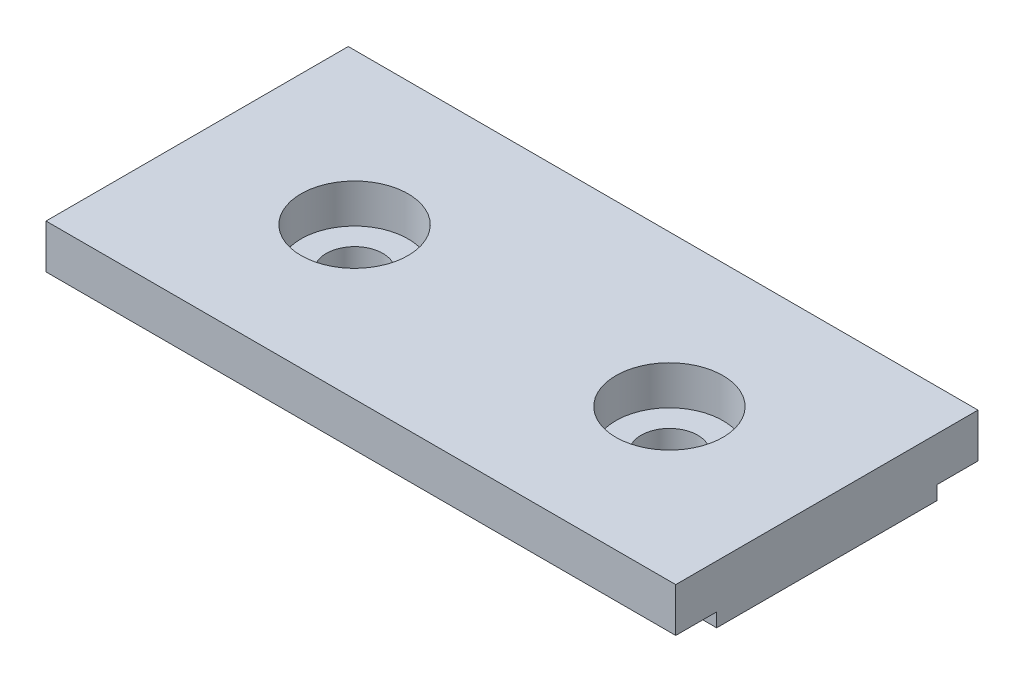
ISO-10303-21;
HEADER;
FILE_DESCRIPTION(('STEP AP214'),'2;1');
FILE_NAME('part.step','',(''),(''),'','','');
FILE_SCHEMA(('AUTOMOTIVE_DESIGN { 1 0 10303 214 1 1 1 1 }'));
ENDSEC;
DATA;
#1=APPLICATION_CONTEXT('core data for automotive mechanical design processes');
#2=APPLICATION_PROTOCOL_DEFINITION('international standard','automotive_design',2000,#1);
#3=PRODUCT_CONTEXT('',#1,'mechanical');
#4=PRODUCT('Part','Part','',(#3));
#5=PRODUCT_RELATED_PRODUCT_CATEGORY('part','',(#4));
#6=PRODUCT_DEFINITION_FORMATION('','',#4);
#7=PRODUCT_DEFINITION_CONTEXT('part definition',#1,'design');
#8=PRODUCT_DEFINITION('design','',#6,#7);
#9=PRODUCT_DEFINITION_SHAPE('','',#8);
#10=(LENGTH_UNIT() NAMED_UNIT(*) SI_UNIT(.MILLI.,.METRE.));
#11=(NAMED_UNIT(*) PLANE_ANGLE_UNIT() SI_UNIT($,.RADIAN.));
#12=(NAMED_UNIT(*) SI_UNIT($,.STERADIAN.) SOLID_ANGLE_UNIT());
#13=UNCERTAINTY_MEASURE_WITH_UNIT(LENGTH_MEASURE(1.E-05),#10,'distance_accuracy_value','');
#14=(GEOMETRIC_REPRESENTATION_CONTEXT(3) GLOBAL_UNCERTAINTY_ASSIGNED_CONTEXT((#13)) GLOBAL_UNIT_ASSIGNED_CONTEXT((#10,
#11,#12)) REPRESENTATION_CONTEXT('',''));
#15=CARTESIAN_POINT('',(0.,0.,0.));
#16=DIRECTION('',(0.,0.,1.));
#17=DIRECTION('',(1.,0.,0.));
#18=AXIS2_PLACEMENT_3D('',#15,#16,#17);
#19=CARTESIAN_POINT('',(50.,6.94545454545454,-12.));
#20=DIRECTION('',(0.,0.,1.));
#21=DIRECTION('',(1.,0.,0.));
#22=AXIS2_PLACEMENT_3D('',#19,#20,#21);
#23=PLANE('',#22);
#24=DIRECTION('',(0.,1.,0.));
#25=VECTOR('',#24,1.);
#26=CARTESIAN_POINT('',(0.,6.94545454545454,-12.));
#27=LINE('',#26,#25);
#28=CARTESIAN_POINT('',(0.,3.44545454545454,-12.));
#29=VERTEX_POINT('',#28);
#30=CARTESIAN_POINT('',(0.,6.94545454545454,-12.));
#31=VERTEX_POINT('',#30);
#32=EDGE_CURVE('E129',#29,#31,#27,.T.);
#33=ORIENTED_EDGE('',*,*,#32,.T.);
#34=DIRECTION('',(-1.,0.,0.));
#35=VECTOR('',#34,1.);
#36=CARTESIAN_POINT('',(50.,6.94545454545454,-12.));
#37=LINE('',#36,#35);
#38=CARTESIAN_POINT('',(50.,6.94545454545454,-12.));
#39=VERTEX_POINT('',#38);
#40=EDGE_CURVE('E11',#39,#31,#37,.T.);
#41=ORIENTED_EDGE('',*,*,#40,.F.);
#42=DIRECTION('',(0.,1.,0.));
#43=VECTOR('',#42,1.);
#44=CARTESIAN_POINT('',(50.,6.94545454545454,-12.));
#45=LINE('',#44,#43);
#46=CARTESIAN_POINT('',(50.,3.44545454545454,-12.));
#47=VERTEX_POINT('',#46);
#48=EDGE_CURVE('E144',#47,#39,#45,.T.);
#49=ORIENTED_EDGE('',*,*,#48,.F.);
#50=DIRECTION('',(-1.,0.,0.));
#51=VECTOR('',#50,1.);
#52=CARTESIAN_POINT('',(50.,3.44545454545454,-12.));
#53=LINE('',#52,#51);
#54=EDGE_CURVE('E125',#47,#29,#53,.T.);
#55=ORIENTED_EDGE('',*,*,#54,.T.);
#56=EDGE_LOOP('',(#33,#41,#49,#55));
#57=FACE_BOUND('',#56,.T.);
#58=ADVANCED_FACE('F33',(#57),#23,.F.);
#59=CARTESIAN_POINT('',(50.,6.94545454545454,12.));
#60=DIRECTION('',(0.,-1.,0.));
#61=DIRECTION('',(0.,0.,-1.));
#62=AXIS2_PLACEMENT_3D('',#59,#60,#61);
#63=PLANE('',#62);
#64=CARTESIAN_POINT('',(12.5,6.94545454545454,0.));
#65=DIRECTION('',(0.,1.,0.));
#66=DIRECTION('',(0.,0.,1.));
#67=AXIS2_PLACEMENT_3D('',#64,#65,#66);
#68=CIRCLE('',#67,4.24999999999999);
#69=CARTESIAN_POINT('',(12.5,6.94545454545454,4.24999999999999));
#70=VERTEX_POINT('',#69);
#71=EDGE_CURVE('E197',#70,#70,#68,.T.);
#72=ORIENTED_EDGE('',*,*,#71,.F.);
#73=EDGE_LOOP('',(#72));
#74=FACE_BOUND('',#73,.T.);
#75=CARTESIAN_POINT('',(37.5,6.94545454545454,0.));
#76=DIRECTION('',(0.,1.,0.));
#77=DIRECTION('',(0.,0.,1.));
#78=AXIS2_PLACEMENT_3D('',#75,#76,#77);
#79=CIRCLE('',#78,4.24999999999999);
#80=CARTESIAN_POINT('',(37.5,6.94545454545454,4.24999999999999));
#81=VERTEX_POINT('',#80);
#82=EDGE_CURVE('E185',#81,#81,#79,.T.);
#83=ORIENTED_EDGE('',*,*,#82,.F.);
#84=EDGE_LOOP('',(#83));
#85=FACE_BOUND('',#84,.T.);
#86=DIRECTION('',(0.,0.,1.));
#87=VECTOR('',#86,1.);
#88=CARTESIAN_POINT('',(0.,6.94545454545454,12.));
#89=LINE('',#88,#87);
#90=CARTESIAN_POINT('',(0.,6.94545454545454,12.));
#91=VERTEX_POINT('',#90);
#92=EDGE_CURVE('E132',#31,#91,#89,.T.);
#93=ORIENTED_EDGE('',*,*,#92,.T.);
#94=DIRECTION('',(-1.,0.,0.));
#95=VECTOR('',#94,1.);
#96=CARTESIAN_POINT('',(50.,6.94545454545454,12.));
#97=LINE('',#96,#95);
#98=CARTESIAN_POINT('',(50.,6.94545454545454,12.));
#99=VERTEX_POINT('',#98);
#100=EDGE_CURVE('E41',#99,#91,#97,.T.);
#101=ORIENTED_EDGE('',*,*,#100,.F.);
#102=DIRECTION('',(0.,0.,1.));
#103=VECTOR('',#102,1.);
#104=CARTESIAN_POINT('',(50.,6.94545454545454,12.));
#105=LINE('',#104,#103);
#106=EDGE_CURVE('E92',#39,#99,#105,.T.);
#107=ORIENTED_EDGE('',*,*,#106,.F.);
#108=ORIENTED_EDGE('',*,*,#40,.T.);
#109=EDGE_LOOP('',(#93,#101,#107,#108));
#110=FACE_BOUND('',#109,.T.);
#111=ADVANCED_FACE('F203',(#74,#85,#110),#63,.F.);
#112=CARTESIAN_POINT('',(50.,6.94545454545454,12.));
#113=DIRECTION('',(0.,0.,-1.));
#114=DIRECTION('',(-1.,0.,0.));
#115=AXIS2_PLACEMENT_3D('',#112,#113,#114);
#116=PLANE('',#115);
#117=DIRECTION('',(0.,-1.,0.));
#118=VECTOR('',#117,1.);
#119=CARTESIAN_POINT('',(0.,6.94545454545454,12.));
#120=LINE('',#119,#118);
#121=CARTESIAN_POINT('',(0.,3.44545454545454,12.));
#122=VERTEX_POINT('',#121);
#123=EDGE_CURVE('E135',#91,#122,#120,.T.);
#124=ORIENTED_EDGE('',*,*,#123,.T.);
#125=DIRECTION('',(-1.,0.,0.));
#126=VECTOR('',#125,1.);
#127=CARTESIAN_POINT('',(50.,3.44545454545454,12.));
#128=LINE('',#127,#126);
#129=CARTESIAN_POINT('',(50.,3.44545454545454,12.));
#130=VERTEX_POINT('',#129);
#131=EDGE_CURVE('E151',#130,#122,#128,.T.);
#132=ORIENTED_EDGE('',*,*,#131,.F.);
#133=DIRECTION('',(0.,-1.,0.));
#134=VECTOR('',#133,1.);
#135=CARTESIAN_POINT('',(50.,6.94545454545454,12.));
#136=LINE('',#135,#134);
#137=EDGE_CURVE('E159',#99,#130,#136,.T.);
#138=ORIENTED_EDGE('',*,*,#137,.F.);
#139=ORIENTED_EDGE('',*,*,#100,.T.);
#140=EDGE_LOOP('',(#124,#132,#138,#139));
#141=FACE_BOUND('',#140,.T.);
#142=ADVANCED_FACE('F157',(#141),#116,.F.);
#143=CARTESIAN_POINT('',(50.,3.44545454545454,12.));
#144=DIRECTION('',(0.,1.,0.));
#145=DIRECTION('',(0.,0.,1.));
#146=AXIS2_PLACEMENT_3D('',#143,#144,#145);
#147=PLANE('',#146);
#148=DIRECTION('',(0.,0.,-1.));
#149=VECTOR('',#148,1.);
#150=CARTESIAN_POINT('',(0.,3.44545454545454,12.));
#151=LINE('',#150,#149);
#152=CARTESIAN_POINT('',(0.,3.44545454545454,8.75));
#153=VERTEX_POINT('',#152);
#154=EDGE_CURVE('E137',#122,#153,#151,.T.);
#155=ORIENTED_EDGE('',*,*,#154,.T.);
#156=DIRECTION('',(-1.,0.,0.));
#157=VECTOR('',#156,1.);
#158=CARTESIAN_POINT('',(50.,3.44545454545454,8.75));
#159=LINE('',#158,#157);
#160=CARTESIAN_POINT('',(50.,3.44545454545454,8.75));
#161=VERTEX_POINT('',#160);
#162=EDGE_CURVE('E148',#161,#153,#159,.T.);
#163=ORIENTED_EDGE('',*,*,#162,.F.);
#164=DIRECTION('',(0.,0.,-1.));
#165=VECTOR('',#164,1.);
#166=CARTESIAN_POINT('',(50.,3.44545454545454,12.));
#167=LINE('',#166,#165);
#168=EDGE_CURVE('E171',#130,#161,#167,.T.);
#169=ORIENTED_EDGE('',*,*,#168,.F.);
#170=ORIENTED_EDGE('',*,*,#131,.T.);
#171=EDGE_LOOP('',(#155,#163,#169,#170));
#172=FACE_BOUND('',#171,.T.);
#173=ADVANCED_FACE('F167',(#172),#147,.F.);
#174=CARTESIAN_POINT('',(50.,3.44545454545454,8.75));
#175=DIRECTION('',(0.,0.,-1.));
#176=DIRECTION('',(-1.,0.,0.));
#177=AXIS2_PLACEMENT_3D('',#174,#175,#176);
#178=PLANE('',#177);
#179=DIRECTION('',(0.,-1.,0.));
#180=VECTOR('',#179,1.);
#181=CARTESIAN_POINT('',(0.,3.44545454545454,8.75));
#182=LINE('',#181,#180);
#183=CARTESIAN_POINT('',(0.,2.34545454545454,8.75));
#184=VERTEX_POINT('',#183);
#185=EDGE_CURVE('E139',#153,#184,#182,.T.);
#186=ORIENTED_EDGE('',*,*,#185,.T.);
#187=DIRECTION('',(-1.,0.,0.));
#188=VECTOR('',#187,1.);
#189=CARTESIAN_POINT('',(50.,2.34545454545454,8.75));
#190=LINE('',#189,#188);
#191=CARTESIAN_POINT('',(50.,2.34545454545454,8.75));
#192=VERTEX_POINT('',#191);
#193=EDGE_CURVE('E120',#192,#184,#190,.T.);
#194=ORIENTED_EDGE('',*,*,#193,.F.);
#195=DIRECTION('',(0.,-1.,0.));
#196=VECTOR('',#195,1.);
#197=CARTESIAN_POINT('',(50.,3.44545454545454,8.75));
#198=LINE('',#197,#196);
#199=EDGE_CURVE('E111',#161,#192,#198,.T.);
#200=ORIENTED_EDGE('',*,*,#199,.F.);
#201=ORIENTED_EDGE('',*,*,#162,.T.);
#202=EDGE_LOOP('',(#186,#194,#200,#201));
#203=FACE_BOUND('',#202,.T.);
#204=ADVANCED_FACE('F170',(#203),#178,.F.);
#205=CARTESIAN_POINT('',(50.,2.34545454545454,-8.75));
#206=DIRECTION('',(0.,1.,0.));
#207=DIRECTION('',(0.,0.,1.));
#208=AXIS2_PLACEMENT_3D('',#205,#206,#207);
#209=PLANE('',#208);
#210=CARTESIAN_POINT('',(12.5,2.34545454545454,0.));
#211=DIRECTION('',(0.,1.,0.));
#212=DIRECTION('',(0.,0.,1.));
#213=AXIS2_PLACEMENT_3D('',#210,#211,#212);
#214=CIRCLE('',#213,2.25);
#215=CARTESIAN_POINT('',(12.5,2.34545454545454,2.25));
#216=VERTEX_POINT('',#215);
#217=EDGE_CURVE('E188',#216,#216,#214,.T.);
#218=ORIENTED_EDGE('',*,*,#217,.T.);
#219=EDGE_LOOP('',(#218));
#220=FACE_BOUND('',#219,.T.);
#221=CARTESIAN_POINT('',(37.5,2.34545454545454,0.));
#222=DIRECTION('',(0.,1.,0.));
#223=DIRECTION('',(0.,0.,1.));
#224=AXIS2_PLACEMENT_3D('',#221,#222,#223);
#225=CIRCLE('',#224,2.25);
#226=CARTESIAN_POINT('',(37.5,2.34545454545454,2.25));
#227=VERTEX_POINT('',#226);
#228=EDGE_CURVE('E133',#227,#227,#225,.T.);
#229=ORIENTED_EDGE('',*,*,#228,.T.);
#230=EDGE_LOOP('',(#229));
#231=FACE_BOUND('',#230,.T.);
#232=DIRECTION('',(0.,0.,-1.));
#233=VECTOR('',#232,1.);
#234=CARTESIAN_POINT('',(0.,2.34545454545454,-8.75));
#235=LINE('',#234,#233);
#236=CARTESIAN_POINT('',(0.,2.34545454545454,-8.75));
#237=VERTEX_POINT('',#236);
#238=EDGE_CURVE('E119',#184,#237,#235,.T.);
#239=ORIENTED_EDGE('',*,*,#238,.T.);
#240=DIRECTION('',(-1.,0.,0.));
#241=VECTOR('',#240,1.);
#242=CARTESIAN_POINT('',(50.,2.34545454545454,-8.75));
#243=LINE('',#242,#241);
#244=CARTESIAN_POINT('',(50.,2.34545454545454,-8.75));
#245=VERTEX_POINT('',#244);
#246=EDGE_CURVE('E116',#245,#237,#243,.T.);
#247=ORIENTED_EDGE('',*,*,#246,.F.);
#248=DIRECTION('',(0.,0.,-1.));
#249=VECTOR('',#248,1.);
#250=CARTESIAN_POINT('',(50.,2.34545454545454,-8.75));
#251=LINE('',#250,#249);
#252=EDGE_CURVE('E105',#192,#245,#251,.T.);
#253=ORIENTED_EDGE('',*,*,#252,.F.);
#254=ORIENTED_EDGE('',*,*,#193,.T.);
#255=EDGE_LOOP('',(#239,#247,#253,#254));
#256=FACE_BOUND('',#255,.T.);
#257=ADVANCED_FACE('F117',(#220,#231,#256),#209,.F.);
#258=CARTESIAN_POINT('',(50.,3.44545454545454,-8.75));
#259=DIRECTION('',(0.,0.,1.));
#260=DIRECTION('',(1.,0.,0.));
#261=AXIS2_PLACEMENT_3D('',#258,#259,#260);
#262=PLANE('',#261);
#263=DIRECTION('',(0.,1.,0.));
#264=VECTOR('',#263,1.);
#265=CARTESIAN_POINT('',(0.,3.44545454545454,-8.75));
#266=LINE('',#265,#264);
#267=CARTESIAN_POINT('',(0.,3.44545454545454,-8.75));
#268=VERTEX_POINT('',#267);
#269=EDGE_CURVE('E78',#237,#268,#266,.T.);
#270=ORIENTED_EDGE('',*,*,#269,.T.);
#271=DIRECTION('',(-1.,0.,0.));
#272=VECTOR('',#271,1.);
#273=CARTESIAN_POINT('',(50.,3.44545454545454,-8.75));
#274=LINE('',#273,#272);
#275=CARTESIAN_POINT('',(50.,3.44545454545454,-8.75));
#276=VERTEX_POINT('',#275);
#277=EDGE_CURVE('E121',#276,#268,#274,.T.);
#278=ORIENTED_EDGE('',*,*,#277,.F.);
#279=DIRECTION('',(0.,1.,0.));
#280=VECTOR('',#279,1.);
#281=CARTESIAN_POINT('',(50.,3.44545454545454,-8.75));
#282=LINE('',#281,#280);
#283=EDGE_CURVE('E109',#245,#276,#282,.T.);
#284=ORIENTED_EDGE('',*,*,#283,.F.);
#285=ORIENTED_EDGE('',*,*,#246,.T.);
#286=EDGE_LOOP('',(#270,#278,#284,#285));
#287=FACE_BOUND('',#286,.T.);
#288=ADVANCED_FACE('F123',(#287),#262,.F.);
#289=CARTESIAN_POINT('',(50.,3.44545454545454,-12.));
#290=DIRECTION('',(0.,1.,0.));
#291=DIRECTION('',(0.,0.,1.));
#292=AXIS2_PLACEMENT_3D('',#289,#290,#291);
#293=PLANE('',#292);
#294=DIRECTION('',(0.,0.,-1.));
#295=VECTOR('',#294,1.);
#296=CARTESIAN_POINT('',(0.,3.44545454545454,-12.));
#297=LINE('',#296,#295);
#298=EDGE_CURVE('E84',#268,#29,#297,.T.);
#299=ORIENTED_EDGE('',*,*,#298,.T.);
#300=ORIENTED_EDGE('',*,*,#54,.F.);
#301=DIRECTION('',(0.,0.,-1.));
#302=VECTOR('',#301,1.);
#303=CARTESIAN_POINT('',(50.,3.44545454545454,-12.));
#304=LINE('',#303,#302);
#305=EDGE_CURVE('E49',#276,#47,#304,.T.);
#306=ORIENTED_EDGE('',*,*,#305,.F.);
#307=ORIENTED_EDGE('',*,*,#277,.T.);
#308=EDGE_LOOP('',(#299,#300,#306,#307));
#309=FACE_BOUND('',#308,.T.);
#310=ADVANCED_FACE('F210',(#309),#293,.F.);
#311=CARTESIAN_POINT('',(50.,0.,0.));
#312=DIRECTION('',(-1.,0.,0.));
#313=DIRECTION('',(0.,0.,1.));
#314=AXIS2_PLACEMENT_3D('',#311,#312,#313);
#315=PLANE('',#314);
#316=ORIENTED_EDGE('',*,*,#48,.T.);
#317=ORIENTED_EDGE('',*,*,#106,.T.);
#318=ORIENTED_EDGE('',*,*,#137,.T.);
#319=ORIENTED_EDGE('',*,*,#168,.T.);
#320=ORIENTED_EDGE('',*,*,#199,.T.);
#321=ORIENTED_EDGE('',*,*,#252,.T.);
#322=ORIENTED_EDGE('',*,*,#283,.T.);
#323=ORIENTED_EDGE('',*,*,#305,.T.);
#324=EDGE_LOOP('',(#316,#317,#318,#319,#320,#321,#322,#323));
#325=FACE_BOUND('',#324,.T.);
#326=ADVANCED_FACE('F107',(#325),#315,.F.);
#327=CARTESIAN_POINT('',(0.,0.,0.));
#328=DIRECTION('',(-1.,0.,0.));
#329=DIRECTION('',(0.,0.,1.));
#330=AXIS2_PLACEMENT_3D('',#327,#328,#329);
#331=PLANE('',#330);
#332=ORIENTED_EDGE('',*,*,#32,.F.);
#333=ORIENTED_EDGE('',*,*,#298,.F.);
#334=ORIENTED_EDGE('',*,*,#269,.F.);
#335=ORIENTED_EDGE('',*,*,#238,.F.);
#336=ORIENTED_EDGE('',*,*,#185,.F.);
#337=ORIENTED_EDGE('',*,*,#154,.F.);
#338=ORIENTED_EDGE('',*,*,#123,.F.);
#339=ORIENTED_EDGE('',*,*,#92,.F.);
#340=EDGE_LOOP('',(#332,#333,#334,#335,#336,#337,#338,#339));
#341=FACE_BOUND('',#340,.T.);
#342=ADVANCED_FACE('F163',(#341),#331,.T.);
#343=CARTESIAN_POINT('',(37.5,6.94545454545454,0.));
#344=DIRECTION('',(0.,1.,0.));
#345=DIRECTION('',(0.,0.,1.));
#346=AXIS2_PLACEMENT_3D('',#343,#344,#345);
#347=CYLINDRICAL_SURFACE('',#346,2.25000000000001);
#348=ORIENTED_EDGE('',*,*,#228,.F.);
#349=EDGE_LOOP('',(#348));
#350=FACE_BOUND('',#349,.T.);
#351=CARTESIAN_POINT('',(37.5,3.84545454545454,0.));
#352=DIRECTION('',(0.,1.,0.));
#353=DIRECTION('',(0.,0.,1.));
#354=AXIS2_PLACEMENT_3D('',#351,#352,#353);
#355=CIRCLE('',#354,2.25000000000002);
#356=CARTESIAN_POINT('',(37.5,3.84545454545454,2.25000000000002));
#357=VERTEX_POINT('',#356);
#358=EDGE_CURVE('E179',#357,#357,#355,.T.);
#359=ORIENTED_EDGE('',*,*,#358,.T.);
#360=EDGE_LOOP('',(#359));
#361=FACE_BOUND('',#360,.T.);
#362=ADVANCED_FACE('F275',(#350,#361),#347,.F.);
#363=CARTESIAN_POINT('',(39.75,3.84545454545454,0.));
#364=DIRECTION('',(0.,-1.,0.));
#365=DIRECTION('',(0.,0.,-1.));
#366=AXIS2_PLACEMENT_3D('',#363,#364,#365);
#367=PLANE('',#366);
#368=ORIENTED_EDGE('',*,*,#358,.F.);
#369=EDGE_LOOP('',(#368));
#370=FACE_BOUND('',#369,.T.);
#371=CARTESIAN_POINT('',(37.5,3.84545454545454,0.));
#372=DIRECTION('',(0.,1.,0.));
#373=DIRECTION('',(0.,0.,1.));
#374=AXIS2_PLACEMENT_3D('',#371,#372,#373);
#375=CIRCLE('',#374,4.24999999999999);
#376=CARTESIAN_POINT('',(37.5,3.84545454545454,4.24999999999999));
#377=VERTEX_POINT('',#376);
#378=EDGE_CURVE('E182',#377,#377,#375,.T.);
#379=ORIENTED_EDGE('',*,*,#378,.T.);
#380=EDGE_LOOP('',(#379));
#381=FACE_BOUND('',#380,.T.);
#382=ADVANCED_FACE('F283',(#370,#381),#367,.F.);
#383=CARTESIAN_POINT('',(37.5,6.94545454545454,0.));
#384=DIRECTION('',(0.,1.,0.));
#385=DIRECTION('',(0.,0.,1.));
#386=AXIS2_PLACEMENT_3D('',#383,#384,#385);
#387=CYLINDRICAL_SURFACE('',#386,4.24999999999999);
#388=ORIENTED_EDGE('',*,*,#378,.F.);
#389=EDGE_LOOP('',(#388));
#390=FACE_BOUND('',#389,.T.);
#391=ORIENTED_EDGE('',*,*,#82,.T.);
#392=EDGE_LOOP('',(#391));
#393=FACE_BOUND('',#392,.T.);
#394=ADVANCED_FACE('F290',(#390,#393),#387,.F.);
#395=CARTESIAN_POINT('',(12.5,6.94545454545454,0.));
#396=DIRECTION('',(0.,1.,0.));
#397=DIRECTION('',(0.,0.,1.));
#398=AXIS2_PLACEMENT_3D('',#395,#396,#397);
#399=CYLINDRICAL_SURFACE('',#398,2.25000000000001);
#400=ORIENTED_EDGE('',*,*,#217,.F.);
#401=EDGE_LOOP('',(#400));
#402=FACE_BOUND('',#401,.T.);
#403=CARTESIAN_POINT('',(12.5,3.84545454545454,0.));
#404=DIRECTION('',(0.,1.,0.));
#405=DIRECTION('',(0.,0.,1.));
#406=AXIS2_PLACEMENT_3D('',#403,#404,#405);
#407=CIRCLE('',#406,2.25000000000001);
#408=CARTESIAN_POINT('',(12.5,3.84545454545454,2.25000000000001));
#409=VERTEX_POINT('',#408);
#410=EDGE_CURVE('E191',#409,#409,#407,.T.);
#411=ORIENTED_EDGE('',*,*,#410,.T.);
#412=EDGE_LOOP('',(#411));
#413=FACE_BOUND('',#412,.T.);
#414=ADVANCED_FACE('F298',(#402,#413),#399,.F.);
#415=CARTESIAN_POINT('',(14.75,3.84545454545454,0.));
#416=DIRECTION('',(0.,-1.,0.));
#417=DIRECTION('',(0.,0.,-1.));
#418=AXIS2_PLACEMENT_3D('',#415,#416,#417);
#419=PLANE('',#418);
#420=ORIENTED_EDGE('',*,*,#410,.F.);
#421=EDGE_LOOP('',(#420));
#422=FACE_BOUND('',#421,.T.);
#423=CARTESIAN_POINT('',(12.5,3.84545454545454,0.));
#424=DIRECTION('',(0.,1.,0.));
#425=DIRECTION('',(0.,0.,1.));
#426=AXIS2_PLACEMENT_3D('',#423,#424,#425);
#427=CIRCLE('',#426,4.24999999999999);
#428=CARTESIAN_POINT('',(12.5,3.84545454545454,4.24999999999999));
#429=VERTEX_POINT('',#428);
#430=EDGE_CURVE('E194',#429,#429,#427,.T.);
#431=ORIENTED_EDGE('',*,*,#430,.T.);
#432=EDGE_LOOP('',(#431));
#433=FACE_BOUND('',#432,.T.);
#434=ADVANCED_FACE('F306',(#422,#433),#419,.F.);
#435=CARTESIAN_POINT('',(12.5,6.94545454545454,0.));
#436=DIRECTION('',(0.,1.,0.));
#437=DIRECTION('',(0.,0.,1.));
#438=AXIS2_PLACEMENT_3D('',#435,#436,#437);
#439=CYLINDRICAL_SURFACE('',#438,4.24999999999999);
#440=ORIENTED_EDGE('',*,*,#430,.F.);
#441=EDGE_LOOP('',(#440));
#442=FACE_BOUND('',#441,.T.);
#443=ORIENTED_EDGE('',*,*,#71,.T.);
#444=EDGE_LOOP('',(#443));
#445=FACE_BOUND('',#444,.T.);
#446=ADVANCED_FACE('F201',(#442,#445),#439,.F.);
#447=CLOSED_SHELL('',(#58,#111,#142,#173,#204,#257,#288,#310,#326,#342,#362,#382,#394,#414,#434,#446));
#448=MANIFOLD_SOLID_BREP('B2',#447);
#449=ADVANCED_BREP_SHAPE_REPRESENTATION('',(#18,#448),#14);
#450=SHAPE_DEFINITION_REPRESENTATION(#9,#449);
ENDSEC;
END-ISO-10303-21;
